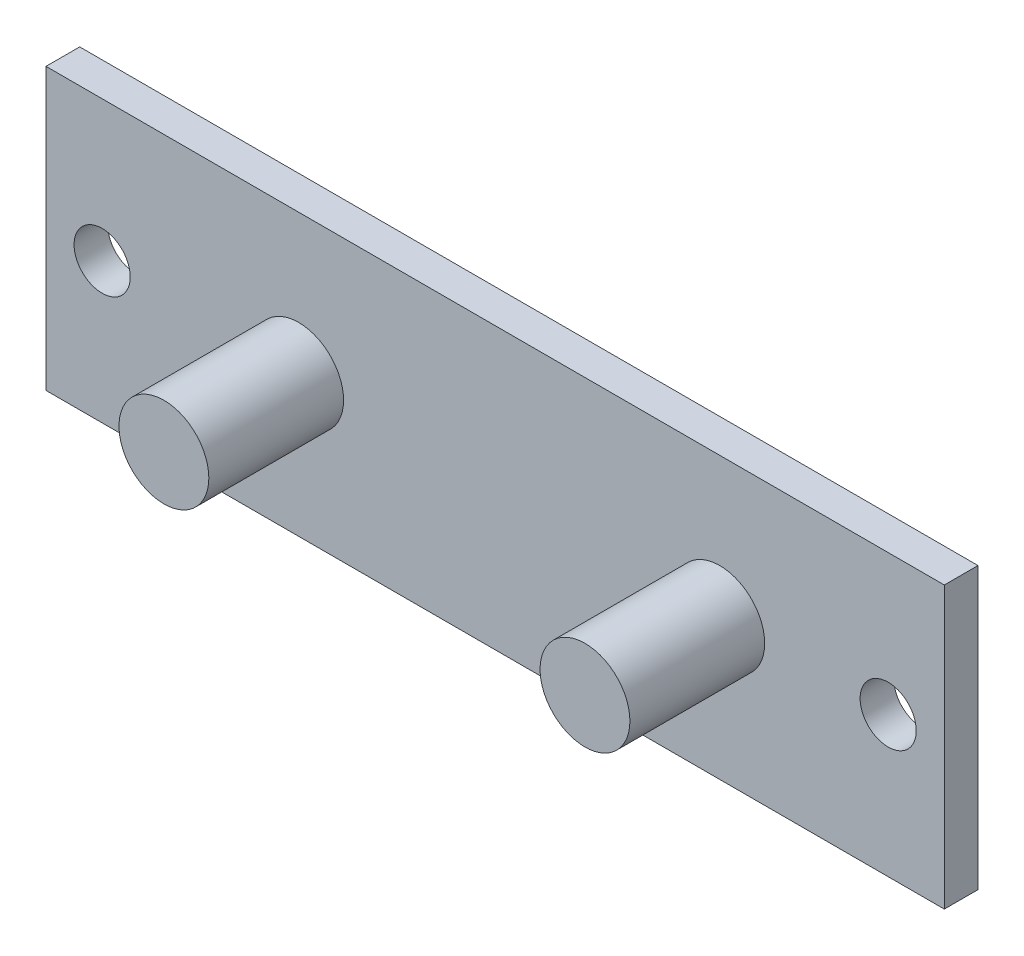
ISO-10303-21;
HEADER;
FILE_DESCRIPTION(('STEP AP214'),'2;1');
FILE_NAME('part.step','',(''),(''),'','','');
FILE_SCHEMA(('AUTOMOTIVE_DESIGN { 1 0 10303 214 1 1 1 1 }'));
ENDSEC;
DATA;
#1=APPLICATION_CONTEXT('core data for automotive mechanical design processes');
#2=APPLICATION_PROTOCOL_DEFINITION('international standard','automotive_design',2000,#1);
#3=PRODUCT_CONTEXT('',#1,'mechanical');
#4=PRODUCT('Part','Part','',(#3));
#5=PRODUCT_RELATED_PRODUCT_CATEGORY('part','',(#4));
#6=PRODUCT_DEFINITION_FORMATION('','',#4);
#7=PRODUCT_DEFINITION_CONTEXT('part definition',#1,'design');
#8=PRODUCT_DEFINITION('design','',#6,#7);
#9=PRODUCT_DEFINITION_SHAPE('','',#8);
#10=(LENGTH_UNIT() NAMED_UNIT(*) SI_UNIT(.MILLI.,.METRE.));
#11=(NAMED_UNIT(*) PLANE_ANGLE_UNIT() SI_UNIT($,.RADIAN.));
#12=(NAMED_UNIT(*) SI_UNIT($,.STERADIAN.) SOLID_ANGLE_UNIT());
#13=UNCERTAINTY_MEASURE_WITH_UNIT(LENGTH_MEASURE(1.E-05),#10,'distance_accuracy_value','');
#14=(GEOMETRIC_REPRESENTATION_CONTEXT(3) GLOBAL_UNCERTAINTY_ASSIGNED_CONTEXT((#13)) GLOBAL_UNIT_ASSIGNED_CONTEXT((#10,
#11,#12)) REPRESENTATION_CONTEXT('',''));
#15=CARTESIAN_POINT('',(0.,0.,0.));
#16=DIRECTION('',(0.,0.,1.));
#17=DIRECTION('',(1.,0.,0.));
#18=AXIS2_PLACEMENT_3D('',#15,#16,#17);
#19=CARTESIAN_POINT('',(0.,0.,3.));
#20=DIRECTION('',(-1.,0.,0.));
#21=DIRECTION('',(0.,0.,1.));
#22=AXIS2_PLACEMENT_3D('',#19,#20,#21);
#23=PLANE('',#22);
#24=DIRECTION('',(0.,1.,0.));
#25=VECTOR('',#24,1.);
#26=CARTESIAN_POINT('',(0.,0.,0.));
#27=LINE('',#26,#25);
#28=CARTESIAN_POINT('',(0.,0.,0.));
#29=VERTEX_POINT('',#28);
#30=CARTESIAN_POINT('',(0.,25.,0.));
#31=VERTEX_POINT('',#30);
#32=EDGE_CURVE('E103',#29,#31,#27,.T.);
#33=ORIENTED_EDGE('',*,*,#32,.T.);
#34=DIRECTION('',(0.,0.,-1.));
#35=VECTOR('',#34,1.);
#36=CARTESIAN_POINT('',(0.,25.,3.));
#37=LINE('',#36,#35);
#38=CARTESIAN_POINT('',(0.,25.,3.));
#39=VERTEX_POINT('',#38);
#40=EDGE_CURVE('E11',#39,#31,#37,.T.);
#41=ORIENTED_EDGE('',*,*,#40,.F.);
#42=DIRECTION('',(0.,1.,0.));
#43=VECTOR('',#42,1.);
#44=CARTESIAN_POINT('',(0.,0.,3.));
#45=LINE('',#44,#43);
#46=CARTESIAN_POINT('',(0.,0.,3.));
#47=VERTEX_POINT('',#46);
#48=EDGE_CURVE('E90',#47,#39,#45,.T.);
#49=ORIENTED_EDGE('',*,*,#48,.F.);
#50=DIRECTION('',(0.,0.,-1.));
#51=VECTOR('',#50,1.);
#52=CARTESIAN_POINT('',(0.,0.,3.));
#53=LINE('',#52,#51);
#54=EDGE_CURVE('E99',#47,#29,#53,.T.);
#55=ORIENTED_EDGE('',*,*,#54,.T.);
#56=EDGE_LOOP('',(#33,#41,#49,#55));
#57=FACE_BOUND('',#56,.T.);
#58=ADVANCED_FACE('F37',(#57),#23,.F.);
#59=CARTESIAN_POINT('',(0.,25.,3.));
#60=DIRECTION('',(0.,-1.,0.));
#61=DIRECTION('',(1.,0.,0.));
#62=AXIS2_PLACEMENT_3D('',#59,#60,#61);
#63=PLANE('',#62);
#64=DIRECTION('',(-1.,0.,0.));
#65=VECTOR('',#64,1.);
#66=CARTESIAN_POINT('',(0.,25.,0.));
#67=LINE('',#66,#65);
#68=CARTESIAN_POINT('',(-80.,25.,0.));
#69=VERTEX_POINT('',#68);
#70=EDGE_CURVE('E94',#31,#69,#67,.T.);
#71=ORIENTED_EDGE('',*,*,#70,.T.);
#72=DIRECTION('',(0.,0.,-1.));
#73=VECTOR('',#72,1.);
#74=CARTESIAN_POINT('',(-80.,25.,3.));
#75=LINE('',#74,#73);
#76=CARTESIAN_POINT('',(-80.,25.,3.));
#77=VERTEX_POINT('',#76);
#78=EDGE_CURVE('E46',#77,#69,#75,.T.);
#79=ORIENTED_EDGE('',*,*,#78,.F.);
#80=DIRECTION('',(-1.,0.,0.));
#81=VECTOR('',#80,1.);
#82=CARTESIAN_POINT('',(0.,25.,3.));
#83=LINE('',#82,#81);
#84=EDGE_CURVE('E85',#39,#77,#83,.T.);
#85=ORIENTED_EDGE('',*,*,#84,.F.);
#86=ORIENTED_EDGE('',*,*,#40,.T.);
#87=EDGE_LOOP('',(#71,#79,#85,#86));
#88=FACE_BOUND('',#87,.T.);
#89=ADVANCED_FACE('F93',(#88),#63,.F.);
#90=CARTESIAN_POINT('',(-80.,0.,3.));
#91=DIRECTION('',(1.,0.,0.));
#92=DIRECTION('',(0.,0.,-1.));
#93=AXIS2_PLACEMENT_3D('',#90,#91,#92);
#94=PLANE('',#93);
#95=DIRECTION('',(0.,-1.,0.));
#96=VECTOR('',#95,1.);
#97=CARTESIAN_POINT('',(-80.,0.,0.));
#98=LINE('',#97,#96);
#99=CARTESIAN_POINT('',(-80.,0.,0.));
#100=VERTEX_POINT('',#99);
#101=EDGE_CURVE('E72',#69,#100,#98,.T.);
#102=ORIENTED_EDGE('',*,*,#101,.T.);
#103=DIRECTION('',(0.,0.,-1.));
#104=VECTOR('',#103,1.);
#105=CARTESIAN_POINT('',(-80.,0.,3.));
#106=LINE('',#105,#104);
#107=CARTESIAN_POINT('',(-80.,0.,3.));
#108=VERTEX_POINT('',#107);
#109=EDGE_CURVE('E95',#108,#100,#106,.T.);
#110=ORIENTED_EDGE('',*,*,#109,.F.);
#111=DIRECTION('',(0.,-1.,0.));
#112=VECTOR('',#111,1.);
#113=CARTESIAN_POINT('',(-80.,0.,3.));
#114=LINE('',#113,#112);
#115=EDGE_CURVE('E88',#77,#108,#114,.T.);
#116=ORIENTED_EDGE('',*,*,#115,.F.);
#117=ORIENTED_EDGE('',*,*,#78,.T.);
#118=EDGE_LOOP('',(#102,#110,#116,#117));
#119=FACE_BOUND('',#118,.T.);
#120=ADVANCED_FACE('F97',(#119),#94,.F.);
#121=CARTESIAN_POINT('',(0.,0.,3.));
#122=DIRECTION('',(0.,1.,0.));
#123=DIRECTION('',(-1.,0.,0.));
#124=AXIS2_PLACEMENT_3D('',#121,#122,#123);
#125=PLANE('',#124);
#126=DIRECTION('',(1.,0.,0.));
#127=VECTOR('',#126,1.);
#128=CARTESIAN_POINT('',(0.,0.,0.));
#129=LINE('',#128,#127);
#130=EDGE_CURVE('E78',#100,#29,#129,.T.);
#131=ORIENTED_EDGE('',*,*,#130,.T.);
#132=ORIENTED_EDGE('',*,*,#54,.F.);
#133=DIRECTION('',(1.,0.,0.));
#134=VECTOR('',#133,1.);
#135=CARTESIAN_POINT('',(0.,0.,3.));
#136=LINE('',#135,#134);
#137=EDGE_CURVE('E55',#108,#47,#136,.T.);
#138=ORIENTED_EDGE('',*,*,#137,.F.);
#139=ORIENTED_EDGE('',*,*,#109,.T.);
#140=EDGE_LOOP('',(#131,#132,#138,#139));
#141=FACE_BOUND('',#140,.T.);
#142=ADVANCED_FACE('F141',(#141),#125,.F.);
#143=CARTESIAN_POINT('',(0.,0.,3.));
#144=DIRECTION('',(0.,0.,1.));
#145=DIRECTION('',(1.,0.,0.));
#146=AXIS2_PLACEMENT_3D('',#143,#144,#145);
#147=PLANE('',#146);
#148=CARTESIAN_POINT('',(-75.,12.5,3.));
#149=DIRECTION('',(0.,0.,1.));
#150=DIRECTION('',(1.,0.,0.));
#151=AXIS2_PLACEMENT_3D('',#148,#149,#150);
#152=CIRCLE('',#151,2.49999999999999);
#153=CARTESIAN_POINT('',(-72.5,12.5,3.));
#154=VERTEX_POINT('',#153);
#155=EDGE_CURVE('E113',#154,#154,#152,.T.);
#156=ORIENTED_EDGE('',*,*,#155,.F.);
#157=EDGE_LOOP('',(#156));
#158=FACE_BOUND('',#157,.T.);
#159=CARTESIAN_POINT('',(-5.,12.5,3.));
#160=DIRECTION('',(0.,0.,1.));
#161=DIRECTION('',(-1.,0.,0.));
#162=AXIS2_PLACEMENT_3D('',#159,#160,#161);
#163=CIRCLE('',#162,2.49999999999999);
#164=CARTESIAN_POINT('',(-7.5,12.5,3.));
#165=VERTEX_POINT('',#164);
#166=EDGE_CURVE('E119',#165,#165,#163,.T.);
#167=ORIENTED_EDGE('',*,*,#166,.F.);
#168=EDGE_LOOP('',(#167));
#169=FACE_BOUND('',#168,.T.);
#170=CARTESIAN_POINT('',(-20.,12.5,3.));
#171=DIRECTION('',(0.,0.,1.));
#172=DIRECTION('',(1.,0.,0.));
#173=AXIS2_PLACEMENT_3D('',#170,#171,#172);
#174=CIRCLE('',#173,4.);
#175=CARTESIAN_POINT('',(-16.,12.5,3.));
#176=VERTEX_POINT('',#175);
#177=EDGE_CURVE('E117',#176,#176,#174,.T.);
#178=ORIENTED_EDGE('',*,*,#177,.F.);
#179=EDGE_LOOP('',(#178));
#180=FACE_BOUND('',#179,.T.);
#181=CARTESIAN_POINT('',(-57.5,12.5,3.));
#182=DIRECTION('',(0.,0.,1.));
#183=DIRECTION('',(1.,0.,0.));
#184=AXIS2_PLACEMENT_3D('',#181,#182,#183);
#185=CIRCLE('',#184,4.00000000000001);
#186=CARTESIAN_POINT('',(-53.5,12.5,3.));
#187=VERTEX_POINT('',#186);
#188=EDGE_CURVE('E129',#187,#187,#185,.T.);
#189=ORIENTED_EDGE('',*,*,#188,.F.);
#190=EDGE_LOOP('',(#189));
#191=FACE_BOUND('',#190,.T.);
#192=ORIENTED_EDGE('',*,*,#48,.T.);
#193=ORIENTED_EDGE('',*,*,#84,.T.);
#194=ORIENTED_EDGE('',*,*,#115,.T.);
#195=ORIENTED_EDGE('',*,*,#137,.T.);
#196=EDGE_LOOP('',(#192,#193,#194,#195));
#197=FACE_BOUND('',#196,.T.);
#198=ADVANCED_FACE('F86',(#158,#169,#180,#191,#197),#147,.T.);
#199=CARTESIAN_POINT('',(0.,0.,0.));
#200=DIRECTION('',(0.,0.,1.));
#201=DIRECTION('',(1.,0.,0.));
#202=AXIS2_PLACEMENT_3D('',#199,#200,#201);
#203=PLANE('',#202);
#204=CARTESIAN_POINT('',(-75.,12.5,0.));
#205=DIRECTION('',(0.,0.,1.));
#206=DIRECTION('',(1.,0.,0.));
#207=AXIS2_PLACEMENT_3D('',#204,#205,#206);
#208=CIRCLE('',#207,2.49999999999999);
#209=CARTESIAN_POINT('',(-72.5,12.5,0.));
#210=VERTEX_POINT('',#209);
#211=EDGE_CURVE('E40',#210,#210,#208,.T.);
#212=ORIENTED_EDGE('',*,*,#211,.T.);
#213=EDGE_LOOP('',(#212));
#214=FACE_BOUND('',#213,.T.);
#215=CARTESIAN_POINT('',(-5.,12.5,0.));
#216=DIRECTION('',(0.,0.,1.));
#217=DIRECTION('',(1.,0.,0.));
#218=AXIS2_PLACEMENT_3D('',#215,#216,#217);
#219=CIRCLE('',#218,2.49999999999999);
#220=CARTESIAN_POINT('',(-2.50000000000001,12.5,0.));
#221=VERTEX_POINT('',#220);
#222=EDGE_CURVE('E111',#221,#221,#219,.T.);
#223=ORIENTED_EDGE('',*,*,#222,.T.);
#224=EDGE_LOOP('',(#223));
#225=FACE_BOUND('',#224,.T.);
#226=ORIENTED_EDGE('',*,*,#32,.F.);
#227=ORIENTED_EDGE('',*,*,#130,.F.);
#228=ORIENTED_EDGE('',*,*,#101,.F.);
#229=ORIENTED_EDGE('',*,*,#70,.F.);
#230=EDGE_LOOP('',(#226,#227,#228,#229));
#231=FACE_BOUND('',#230,.T.);
#232=ADVANCED_FACE('F140',(#214,#225,#231),#203,.F.);
#233=CARTESIAN_POINT('',(-57.5,12.5,15.));
#234=DIRECTION('',(0.,0.,-1.));
#235=DIRECTION('',(-1.,0.,0.));
#236=AXIS2_PLACEMENT_3D('',#233,#234,#235);
#237=CYLINDRICAL_SURFACE('',#236,4.00000000000001);
#238=CARTESIAN_POINT('',(-57.5,12.5,15.));
#239=DIRECTION('',(0.,0.,1.));
#240=DIRECTION('',(1.,0.,0.));
#241=AXIS2_PLACEMENT_3D('',#238,#239,#240);
#242=CIRCLE('',#241,4.00000000000001);
#243=CARTESIAN_POINT('',(-53.5,12.5,15.));
#244=VERTEX_POINT('',#243);
#245=EDGE_CURVE('E106',#244,#244,#242,.T.);
#246=ORIENTED_EDGE('',*,*,#245,.F.);
#247=EDGE_LOOP('',(#246));
#248=FACE_BOUND('',#247,.T.);
#249=ORIENTED_EDGE('',*,*,#188,.T.);
#250=EDGE_LOOP('',(#249));
#251=FACE_BOUND('',#250,.T.);
#252=ADVANCED_FACE('F137',(#248,#251),#237,.T.);
#253=CARTESIAN_POINT('',(-57.5,12.5,15.));
#254=DIRECTION('',(0.,0.,1.));
#255=DIRECTION('',(1.,0.,0.));
#256=AXIS2_PLACEMENT_3D('',#253,#254,#255);
#257=PLANE('',#256);
#258=ORIENTED_EDGE('',*,*,#245,.T.);
#259=EDGE_LOOP('',(#258));
#260=FACE_BOUND('',#259,.T.);
#261=ADVANCED_FACE('F180',(#260),#257,.T.);
#262=CARTESIAN_POINT('',(-20.,12.5,15.));
#263=DIRECTION('',(0.,0.,-1.));
#264=DIRECTION('',(-1.,0.,0.));
#265=AXIS2_PLACEMENT_3D('',#262,#263,#264);
#266=CYLINDRICAL_SURFACE('',#265,4.);
#267=CARTESIAN_POINT('',(-20.,12.5,15.));
#268=DIRECTION('',(0.,0.,1.));
#269=DIRECTION('',(1.,0.,0.));
#270=AXIS2_PLACEMENT_3D('',#267,#268,#269);
#271=CIRCLE('',#270,4.);
#272=CARTESIAN_POINT('',(-16.,12.5,15.));
#273=VERTEX_POINT('',#272);
#274=EDGE_CURVE('E126',#273,#273,#271,.T.);
#275=ORIENTED_EDGE('',*,*,#274,.F.);
#276=EDGE_LOOP('',(#275));
#277=FACE_BOUND('',#276,.T.);
#278=ORIENTED_EDGE('',*,*,#177,.T.);
#279=EDGE_LOOP('',(#278));
#280=FACE_BOUND('',#279,.T.);
#281=ADVANCED_FACE('F190',(#277,#280),#266,.T.);
#282=CARTESIAN_POINT('',(-20.,12.5,15.));
#283=DIRECTION('',(0.,0.,1.));
#284=DIRECTION('',(1.,0.,0.));
#285=AXIS2_PLACEMENT_3D('',#282,#283,#284);
#286=PLANE('',#285);
#287=ORIENTED_EDGE('',*,*,#274,.T.);
#288=EDGE_LOOP('',(#287));
#289=FACE_BOUND('',#288,.T.);
#290=ADVANCED_FACE('F200',(#289),#286,.T.);
#291=CARTESIAN_POINT('',(-5.,12.5,-5.));
#292=DIRECTION('',(0.,0.,1.));
#293=DIRECTION('',(1.,0.,0.));
#294=AXIS2_PLACEMENT_3D('',#291,#292,#293);
#295=CYLINDRICAL_SURFACE('',#294,2.49999999999999);
#296=ORIENTED_EDGE('',*,*,#166,.T.);
#297=EDGE_LOOP('',(#296));
#298=FACE_BOUND('',#297,.T.);
#299=ORIENTED_EDGE('',*,*,#222,.F.);
#300=EDGE_LOOP('',(#299));
#301=FACE_BOUND('',#300,.T.);
#302=ADVANCED_FACE('F209',(#298,#301),#295,.F.);
#303=CARTESIAN_POINT('',(-75.,12.5,-5.));
#304=DIRECTION('',(0.,0.,1.));
#305=DIRECTION('',(1.,0.,0.));
#306=AXIS2_PLACEMENT_3D('',#303,#304,#305);
#307=CYLINDRICAL_SURFACE('',#306,2.49999999999999);
#308=ORIENTED_EDGE('',*,*,#155,.T.);
#309=EDGE_LOOP('',(#308));
#310=FACE_BOUND('',#309,.T.);
#311=ORIENTED_EDGE('',*,*,#211,.F.);
#312=EDGE_LOOP('',(#311));
#313=FACE_BOUND('',#312,.T.);
#314=ADVANCED_FACE('F228',(#310,#313),#307,.F.);
#315=CLOSED_SHELL('',(#58,#89,#120,#142,#198,#232,#252,#261,#281,#290,#302,#314));
#316=MANIFOLD_SOLID_BREP('B2',#315);
#317=ADVANCED_BREP_SHAPE_REPRESENTATION('',(#18,#316),#14);
#318=SHAPE_DEFINITION_REPRESENTATION(#9,#317);
ENDSEC;
END-ISO-10303-21;
